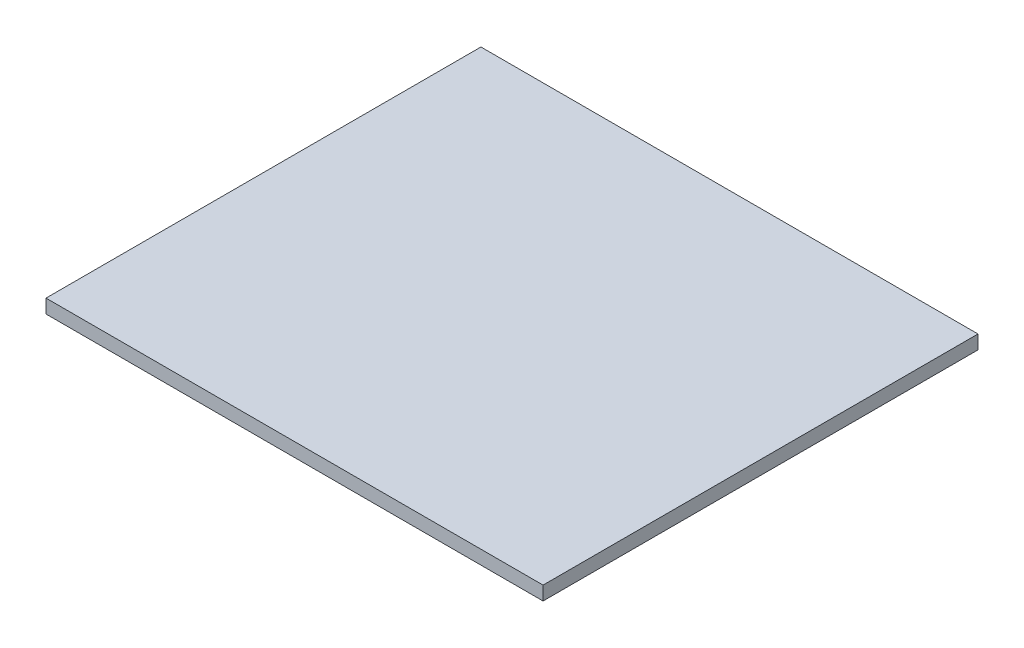
ISO-10303-21;
HEADER;
FILE_DESCRIPTION(('STEP AP214'),'2;1');
FILE_NAME('part.step','',(''),(''),'','','');
FILE_SCHEMA(('AUTOMOTIVE_DESIGN { 1 0 10303 214 1 1 1 1 }'));
ENDSEC;
DATA;
#1=APPLICATION_CONTEXT('core data for automotive mechanical design processes');
#2=APPLICATION_PROTOCOL_DEFINITION('international standard','automotive_design',2000,#1);
#3=PRODUCT_CONTEXT('',#1,'mechanical');
#4=PRODUCT('Part','Part','',(#3));
#5=PRODUCT_RELATED_PRODUCT_CATEGORY('part','',(#4));
#6=PRODUCT_DEFINITION_FORMATION('','',#4);
#7=PRODUCT_DEFINITION_CONTEXT('part definition',#1,'design');
#8=PRODUCT_DEFINITION('design','',#6,#7);
#9=PRODUCT_DEFINITION_SHAPE('','',#8);
#10=(LENGTH_UNIT() NAMED_UNIT(*) SI_UNIT(.MILLI.,.METRE.));
#11=(NAMED_UNIT(*) PLANE_ANGLE_UNIT() SI_UNIT($,.RADIAN.));
#12=(NAMED_UNIT(*) SI_UNIT($,.STERADIAN.) SOLID_ANGLE_UNIT());
#13=UNCERTAINTY_MEASURE_WITH_UNIT(LENGTH_MEASURE(1.E-05),#10,'distance_accuracy_value','');
#14=(GEOMETRIC_REPRESENTATION_CONTEXT(3) GLOBAL_UNCERTAINTY_ASSIGNED_CONTEXT((#13)) GLOBAL_UNIT_ASSIGNED_CONTEXT((#10,
#11,#12)) REPRESENTATION_CONTEXT('',''));
#15=CARTESIAN_POINT('',(0.,0.,0.));
#16=DIRECTION('',(0.,0.,1.));
#17=DIRECTION('',(1.,0.,0.));
#18=AXIS2_PLACEMENT_3D('',#15,#16,#17);
#19=CARTESIAN_POINT('',(-360.,20.,315.));
#20=DIRECTION('',(-1.,0.,0.));
#21=DIRECTION('',(0.,0.,1.));
#22=AXIS2_PLACEMENT_3D('',#19,#20,#21);
#23=PLANE('',#22);
#24=DIRECTION('',(0.,0.,-1.));
#25=VECTOR('',#24,1.);
#26=CARTESIAN_POINT('',(-360.,0.,315.));
#27=LINE('',#26,#25);
#28=CARTESIAN_POINT('',(-360.,0.,315.));
#29=VERTEX_POINT('',#28);
#30=CARTESIAN_POINT('',(-360.,0.,-315.));
#31=VERTEX_POINT('',#30);
#32=EDGE_CURVE('E103',#29,#31,#27,.T.);
#33=ORIENTED_EDGE('',*,*,#32,.F.);
#34=DIRECTION('',(0.,-1.,0.));
#35=VECTOR('',#34,1.);
#36=CARTESIAN_POINT('',(-360.,20.,315.));
#37=LINE('',#36,#35);
#38=CARTESIAN_POINT('',(-360.,20.,315.));
#39=VERTEX_POINT('',#38);
#40=EDGE_CURVE('E11',#39,#29,#37,.T.);
#41=ORIENTED_EDGE('',*,*,#40,.F.);
#42=DIRECTION('',(0.,0.,-1.));
#43=VECTOR('',#42,1.);
#44=CARTESIAN_POINT('',(-360.,20.,315.));
#45=LINE('',#44,#43);
#46=CARTESIAN_POINT('',(-360.,20.,-315.));
#47=VERTEX_POINT('',#46);
#48=EDGE_CURVE('E98',#39,#47,#45,.T.);
#49=ORIENTED_EDGE('',*,*,#48,.T.);
#50=DIRECTION('',(0.,-1.,0.));
#51=VECTOR('',#50,1.);
#52=CARTESIAN_POINT('',(-360.,20.,-315.));
#53=LINE('',#52,#51);
#54=EDGE_CURVE('E41',#47,#31,#53,.T.);
#55=ORIENTED_EDGE('',*,*,#54,.T.);
#56=EDGE_LOOP('',(#33,#41,#49,#55));
#57=FACE_BOUND('',#56,.T.);
#58=ADVANCED_FACE('F38',(#57),#23,.T.);
#59=CARTESIAN_POINT('',(-360.,20.,315.));
#60=DIRECTION('',(0.,0.,-1.));
#61=DIRECTION('',(-1.,0.,0.));
#62=AXIS2_PLACEMENT_3D('',#59,#60,#61);
#63=PLANE('',#62);
#64=DIRECTION('',(1.,0.,0.));
#65=VECTOR('',#64,1.);
#66=CARTESIAN_POINT('',(-360.,0.,315.));
#67=LINE('',#66,#65);
#68=CARTESIAN_POINT('',(360.,0.,315.));
#69=VERTEX_POINT('',#68);
#70=EDGE_CURVE('E71',#29,#69,#67,.T.);
#71=ORIENTED_EDGE('',*,*,#70,.T.);
#72=DIRECTION('',(0.,-1.,0.));
#73=VECTOR('',#72,1.);
#74=CARTESIAN_POINT('',(360.,20.,315.));
#75=LINE('',#74,#73);
#76=CARTESIAN_POINT('',(360.,20.,315.));
#77=VERTEX_POINT('',#76);
#78=EDGE_CURVE('E47',#77,#69,#75,.T.);
#79=ORIENTED_EDGE('',*,*,#78,.F.);
#80=DIRECTION('',(1.,0.,0.));
#81=VECTOR('',#80,1.);
#82=CARTESIAN_POINT('',(-360.,20.,315.));
#83=LINE('',#82,#81);
#84=EDGE_CURVE('E88',#39,#77,#83,.T.);
#85=ORIENTED_EDGE('',*,*,#84,.F.);
#86=ORIENTED_EDGE('',*,*,#40,.T.);
#87=EDGE_LOOP('',(#71,#79,#85,#86));
#88=FACE_BOUND('',#87,.T.);
#89=ADVANCED_FACE('F113',(#88),#63,.F.);
#90=CARTESIAN_POINT('',(360.,20.,315.));
#91=DIRECTION('',(-1.,0.,0.));
#92=DIRECTION('',(0.,0.,1.));
#93=AXIS2_PLACEMENT_3D('',#90,#91,#92);
#94=PLANE('',#93);
#95=DIRECTION('',(0.,0.,-1.));
#96=VECTOR('',#95,1.);
#97=CARTESIAN_POINT('',(360.,0.,315.));
#98=LINE('',#97,#96);
#99=CARTESIAN_POINT('',(360.,0.,-315.));
#100=VERTEX_POINT('',#99);
#101=EDGE_CURVE('E95',#69,#100,#98,.T.);
#102=ORIENTED_EDGE('',*,*,#101,.T.);
#103=DIRECTION('',(0.,-1.,0.));
#104=VECTOR('',#103,1.);
#105=CARTESIAN_POINT('',(360.,20.,-315.));
#106=LINE('',#105,#104);
#107=CARTESIAN_POINT('',(360.,20.,-315.));
#108=VERTEX_POINT('',#107);
#109=EDGE_CURVE('E92',#108,#100,#106,.T.);
#110=ORIENTED_EDGE('',*,*,#109,.F.);
#111=DIRECTION('',(0.,0.,-1.));
#112=VECTOR('',#111,1.);
#113=CARTESIAN_POINT('',(360.,20.,315.));
#114=LINE('',#113,#112);
#115=EDGE_CURVE('E83',#77,#108,#114,.T.);
#116=ORIENTED_EDGE('',*,*,#115,.F.);
#117=ORIENTED_EDGE('',*,*,#78,.T.);
#118=EDGE_LOOP('',(#102,#110,#116,#117));
#119=FACE_BOUND('',#118,.T.);
#120=ADVANCED_FACE('F93',(#119),#94,.F.);
#121=CARTESIAN_POINT('',(-360.,20.,-315.));
#122=DIRECTION('',(0.,0.,-1.));
#123=DIRECTION('',(-1.,0.,0.));
#124=AXIS2_PLACEMENT_3D('',#121,#122,#123);
#125=PLANE('',#124);
#126=DIRECTION('',(1.,0.,0.));
#127=VECTOR('',#126,1.);
#128=CARTESIAN_POINT('',(-360.,0.,-315.));
#129=LINE('',#128,#127);
#130=EDGE_CURVE('E106',#31,#100,#129,.T.);
#131=ORIENTED_EDGE('',*,*,#130,.F.);
#132=ORIENTED_EDGE('',*,*,#54,.F.);
#133=DIRECTION('',(1.,0.,0.));
#134=VECTOR('',#133,1.);
#135=CARTESIAN_POINT('',(-360.,20.,-315.));
#136=LINE('',#135,#134);
#137=EDGE_CURVE('E87',#47,#108,#136,.T.);
#138=ORIENTED_EDGE('',*,*,#137,.T.);
#139=ORIENTED_EDGE('',*,*,#109,.T.);
#140=EDGE_LOOP('',(#131,#132,#138,#139));
#141=FACE_BOUND('',#140,.T.);
#142=ADVANCED_FACE('F97',(#141),#125,.T.);
#143=CARTESIAN_POINT('',(0.,20.,0.));
#144=DIRECTION('',(0.,-1.,0.));
#145=DIRECTION('',(0.,0.,-1.));
#146=AXIS2_PLACEMENT_3D('',#143,#144,#145);
#147=PLANE('',#146);
#148=ORIENTED_EDGE('',*,*,#48,.F.);
#149=ORIENTED_EDGE('',*,*,#84,.T.);
#150=ORIENTED_EDGE('',*,*,#115,.T.);
#151=ORIENTED_EDGE('',*,*,#137,.F.);
#152=EDGE_LOOP('',(#148,#149,#150,#151));
#153=FACE_BOUND('',#152,.T.);
#154=ADVANCED_FACE('F86',(#153),#147,.F.);
#155=CARTESIAN_POINT('',(0.,0.,0.));
#156=DIRECTION('',(0.,-1.,0.));
#157=DIRECTION('',(0.,0.,-1.));
#158=AXIS2_PLACEMENT_3D('',#155,#156,#157);
#159=PLANE('',#158);
#160=ORIENTED_EDGE('',*,*,#32,.T.);
#161=ORIENTED_EDGE('',*,*,#130,.T.);
#162=ORIENTED_EDGE('',*,*,#101,.F.);
#163=ORIENTED_EDGE('',*,*,#70,.F.);
#164=EDGE_LOOP('',(#160,#161,#162,#163));
#165=FACE_BOUND('',#164,.T.);
#166=ADVANCED_FACE('F111',(#165),#159,.T.);
#167=CLOSED_SHELL('',(#58,#89,#120,#142,#154,#166));
#168=MANIFOLD_SOLID_BREP('B2',#167);
#169=ADVANCED_BREP_SHAPE_REPRESENTATION('',(#18,#168),#14);
#170=SHAPE_DEFINITION_REPRESENTATION(#9,#169);
ENDSEC;
END-ISO-10303-21;
